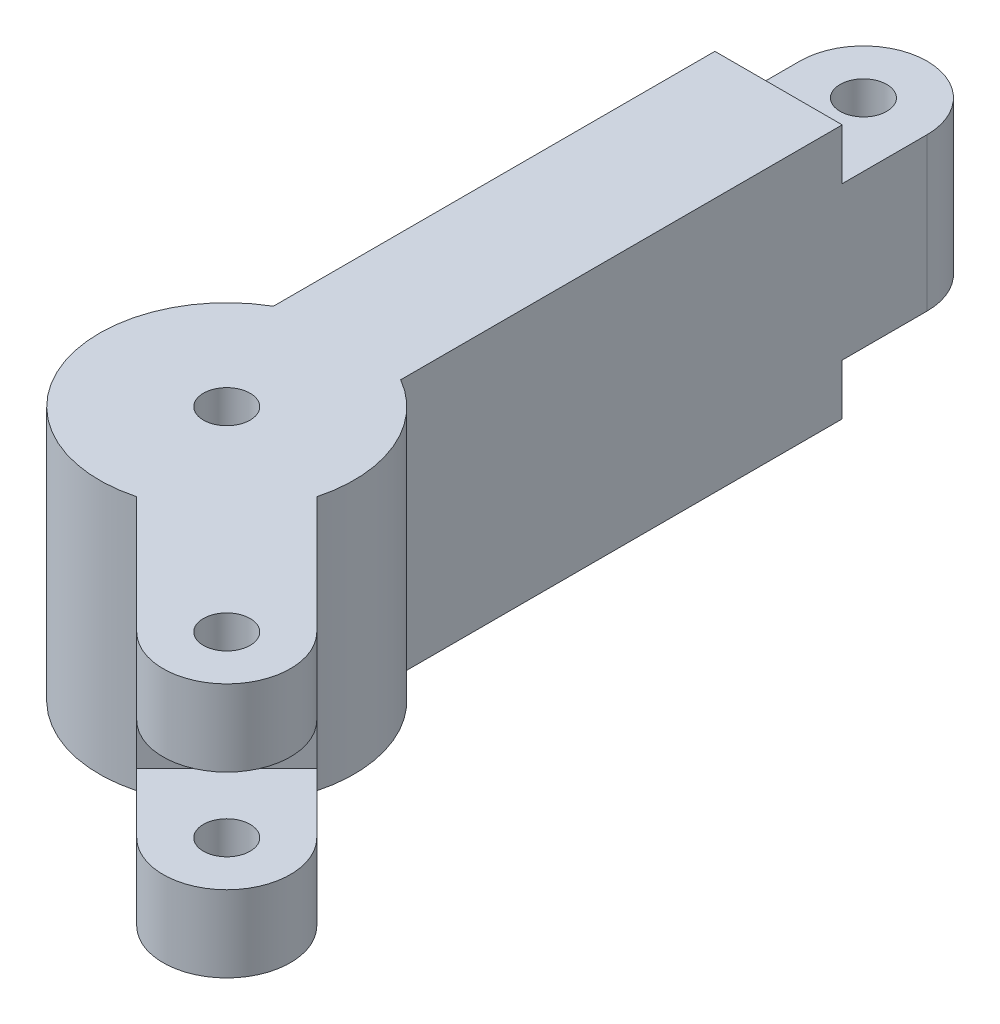
ISO-10303-21;
HEADER;
FILE_DESCRIPTION(('STEP AP214'),'2;1');
FILE_NAME('part.step','',(''),(''),'','','');
FILE_SCHEMA(('AUTOMOTIVE_DESIGN { 1 0 10303 214 1 1 1 1 }'));
ENDSEC;
DATA;
#1=APPLICATION_CONTEXT('core data for automotive mechanical design processes');
#2=APPLICATION_PROTOCOL_DEFINITION('international standard','automotive_design',2000,#1);
#3=PRODUCT_CONTEXT('',#1,'mechanical');
#4=PRODUCT('Part','Part','',(#3));
#5=PRODUCT_RELATED_PRODUCT_CATEGORY('part','',(#4));
#6=PRODUCT_DEFINITION_FORMATION('','',#4);
#7=PRODUCT_DEFINITION_CONTEXT('part definition',#1,'design');
#8=PRODUCT_DEFINITION('design','',#6,#7);
#9=PRODUCT_DEFINITION_SHAPE('','',#8);
#10=(LENGTH_UNIT() NAMED_UNIT(*) SI_UNIT(.MILLI.,.METRE.));
#11=(NAMED_UNIT(*) PLANE_ANGLE_UNIT() SI_UNIT($,.RADIAN.));
#12=(NAMED_UNIT(*) SI_UNIT($,.STERADIAN.) SOLID_ANGLE_UNIT());
#13=UNCERTAINTY_MEASURE_WITH_UNIT(LENGTH_MEASURE(1.E-05),#10,'distance_accuracy_value','');
#14=(GEOMETRIC_REPRESENTATION_CONTEXT(3) GLOBAL_UNCERTAINTY_ASSIGNED_CONTEXT((#13)) GLOBAL_UNIT_ASSIGNED_CONTEXT((#10,
#11,#12)) REPRESENTATION_CONTEXT('',''));
#15=CARTESIAN_POINT('',(0.,0.,0.));
#16=DIRECTION('',(0.,0.,1.));
#17=DIRECTION('',(1.,0.,0.));
#18=AXIS2_PLACEMENT_3D('',#15,#16,#17);
#19=CARTESIAN_POINT('',(-5.3033008588991,30.,5.3033008588991));
#20=DIRECTION('',(0.707106781186548,0.,-0.707106781186547));
#21=DIRECTION('',(-0.707106781186547,0.,-0.707106781186548));
#22=AXIS2_PLACEMENT_3D('',#19,#20,#21);
#23=PLANE('',#22);
#24=DIRECTION('',(0.707106781186547,0.,0.707106781186548));
#25=VECTOR('',#24,1.);
#26=CARTESIAN_POINT('',(-5.3033008588991,9.,5.3033008588991));
#27=LINE('',#26,#25);
#28=CARTESIAN_POINT('',(10.6066017177982,9.,21.2132034355964));
#29=VERTEX_POINT('',#28);
#30=CARTESIAN_POINT('',(17.6776695296637,9.,28.2842712474619));
#31=VERTEX_POINT('',#30);
#32=EDGE_CURVE('E181',#29,#31,#27,.T.);
#33=ORIENTED_EDGE('',*,*,#32,.F.);
#34=DIRECTION('',(0.,-1.,0.));
#35=VECTOR('',#34,1.);
#36=CARTESIAN_POINT('',(10.6066017177982,30.,21.2132034355964));
#37=LINE('',#36,#35);
#38=CARTESIAN_POINT('',(10.6066017177982,21.,21.2132034355964));
#39=VERTEX_POINT('',#38);
#40=EDGE_CURVE('E183',#39,#29,#37,.T.);
#41=ORIENTED_EDGE('',*,*,#40,.F.);
#42=DIRECTION('',(-0.707106781186547,0.,-0.707106781186548));
#43=VECTOR('',#42,1.);
#44=CARTESIAN_POINT('',(-5.3033008588991,21.,5.3033008588991));
#45=LINE('',#44,#43);
#46=CARTESIAN_POINT('',(17.6776695296637,21.,28.2842712474619));
#47=VERTEX_POINT('',#46);
#48=EDGE_CURVE('E156',#47,#39,#45,.T.);
#49=ORIENTED_EDGE('',*,*,#48,.F.);
#50=DIRECTION('',(0.,-1.,0.));
#51=VECTOR('',#50,1.);
#52=CARTESIAN_POINT('',(17.6776695296637,30.,28.2842712474619));
#53=LINE('',#52,#51);
#54=CARTESIAN_POINT('',(17.6776695296637,30.,28.2842712474619));
#55=VERTEX_POINT('',#54);
#56=EDGE_CURVE('E279',#55,#47,#53,.T.);
#57=ORIENTED_EDGE('',*,*,#56,.F.);
#58=DIRECTION('',(0.707106781186547,0.,0.707106781186548));
#59=VECTOR('',#58,1.);
#60=CARTESIAN_POINT('',(-5.3033008588991,30.,5.3033008588991));
#61=LINE('',#60,#59);
#62=CARTESIAN_POINT('',(3.88228567653782,30.,14.488887394336));
#63=VERTEX_POINT('',#62);
#64=EDGE_CURVE('E219',#63,#55,#61,.T.);
#65=ORIENTED_EDGE('',*,*,#64,.F.);
#66=DIRECTION('',(0.,-1.,0.));
#67=VECTOR('',#66,1.);
#68=CARTESIAN_POINT('',(3.88228567653782,30.,14.488887394336));
#69=LINE('',#68,#67);
#70=CARTESIAN_POINT('',(3.88228567653782,0.,14.488887394336));
#71=VERTEX_POINT('',#70);
#72=EDGE_CURVE('E282',#63,#71,#69,.T.);
#73=ORIENTED_EDGE('',*,*,#72,.T.);
#74=DIRECTION('',(0.707106781186547,0.,0.707106781186548));
#75=VECTOR('',#74,1.);
#76=CARTESIAN_POINT('',(-5.3033008588991,0.,5.3033008588991));
#77=LINE('',#76,#75);
#78=CARTESIAN_POINT('',(17.6776695296637,0.,28.2842712474619));
#79=VERTEX_POINT('',#78);
#80=EDGE_CURVE('E242',#71,#79,#77,.T.);
#81=ORIENTED_EDGE('',*,*,#80,.T.);
#82=EDGE_CURVE('E278',#31,#79,#53,.T.);
#83=ORIENTED_EDGE('',*,*,#82,.F.);
#84=EDGE_LOOP('',(#33,#41,#49,#57,#65,#73,#81,#83));
#85=FACE_BOUND('',#84,.T.);
#86=ADVANCED_FACE('F33',(#85),#23,.F.);
#87=CARTESIAN_POINT('',(22.9809703885628,30.,22.9809703885628));
#88=DIRECTION('',(0.,-1.,0.));
#89=DIRECTION('',(0.,0.,-1.));
#90=AXIS2_PLACEMENT_3D('',#87,#88,#89);
#91=CYLINDRICAL_SURFACE('',#90,7.5);
#92=CARTESIAN_POINT('',(22.9809703885628,9.,22.9809703885628));
#93=DIRECTION('',(0.,1.,0.));
#94=DIRECTION('',(0.,0.,1.));
#95=AXIS2_PLACEMENT_3D('',#92,#93,#94);
#96=CIRCLE('',#95,7.5);
#97=CARTESIAN_POINT('',(28.2842712474619,9.,17.6776695296637));
#98=VERTEX_POINT('',#97);
#99=EDGE_CURVE('E179',#31,#98,#96,.T.);
#100=ORIENTED_EDGE('',*,*,#99,.F.);
#101=ORIENTED_EDGE('',*,*,#82,.T.);
#102=CARTESIAN_POINT('',(22.9809703885628,0.,22.9809703885628));
#103=DIRECTION('',(0.,1.,0.));
#104=DIRECTION('',(0.,0.,1.));
#105=AXIS2_PLACEMENT_3D('',#102,#103,#104);
#106=CIRCLE('',#105,7.5);
#107=CARTESIAN_POINT('',(28.2842712474619,0.,17.6776695296637));
#108=VERTEX_POINT('',#107);
#109=EDGE_CURVE('E245',#79,#108,#106,.T.);
#110=ORIENTED_EDGE('',*,*,#109,.T.);
#111=DIRECTION('',(0.,-1.,0.));
#112=VECTOR('',#111,1.);
#113=CARTESIAN_POINT('',(28.2842712474619,30.,17.6776695296637));
#114=LINE('',#113,#112);
#115=EDGE_CURVE('E276',#98,#108,#114,.T.);
#116=ORIENTED_EDGE('',*,*,#115,.F.);
#117=EDGE_LOOP('',(#100,#101,#110,#116));
#118=FACE_BOUND('',#117,.T.);
#119=ADVANCED_FACE('F306',(#118),#91,.T.);
#120=CARTESIAN_POINT('',(22.9809703885628,21.,22.9809703885628));
#121=DIRECTION('',(0.,-1.,0.));
#122=DIRECTION('',(0.,0.,-1.));
#123=AXIS2_PLACEMENT_3D('',#120,#121,#122);
#124=CIRCLE('',#123,7.5);
#125=CARTESIAN_POINT('',(28.2842712474619,21.,17.6776695296637));
#126=VERTEX_POINT('',#125);
#127=EDGE_CURVE('E176',#126,#47,#124,.T.);
#128=ORIENTED_EDGE('',*,*,#127,.F.);
#129=CARTESIAN_POINT('',(28.2842712474619,30.,17.6776695296637));
#130=VERTEX_POINT('',#129);
#131=EDGE_CURVE('E171',#130,#126,#114,.T.);
#132=ORIENTED_EDGE('',*,*,#131,.F.);
#133=CARTESIAN_POINT('',(22.9809703885628,30.,22.9809703885628));
#134=DIRECTION('',(0.,1.,0.));
#135=DIRECTION('',(0.,0.,1.));
#136=AXIS2_PLACEMENT_3D('',#133,#134,#135);
#137=CIRCLE('',#136,7.5);
#138=EDGE_CURVE('E222',#55,#130,#137,.T.);
#139=ORIENTED_EDGE('',*,*,#138,.F.);
#140=ORIENTED_EDGE('',*,*,#56,.T.);
#141=EDGE_LOOP('',(#128,#132,#139,#140));
#142=FACE_BOUND('',#141,.T.);
#143=ADVANCED_FACE('F311',(#142),#91,.T.);
#144=CARTESIAN_POINT('',(5.3033008588991,30.,-5.3033008588991));
#145=DIRECTION('',(0.707106781186547,0.,-0.707106781186548));
#146=DIRECTION('',(-0.707106781186548,0.,-0.707106781186547));
#147=AXIS2_PLACEMENT_3D('',#144,#145,#146);
#148=PLANE('',#147);
#149=DIRECTION('',(0.,-1.,0.));
#150=VECTOR('',#149,1.);
#151=CARTESIAN_POINT('',(21.2132034355964,0.,10.6066017177982));
#152=LINE('',#151,#150);
#153=CARTESIAN_POINT('',(21.2132034355964,21.,10.6066017177982));
#154=VERTEX_POINT('',#153);
#155=CARTESIAN_POINT('',(21.2132034355964,9.,10.6066017177982));
#156=VERTEX_POINT('',#155);
#157=EDGE_CURVE('E163',#154,#156,#152,.T.);
#158=ORIENTED_EDGE('',*,*,#157,.T.);
#159=DIRECTION('',(0.707106781186548,0.,0.707106781186547));
#160=VECTOR('',#159,1.);
#161=CARTESIAN_POINT('',(5.3033008588991,9.,-5.3033008588991));
#162=LINE('',#161,#160);
#163=EDGE_CURVE('E50',#156,#98,#162,.T.);
#164=ORIENTED_EDGE('',*,*,#163,.T.);
#165=ORIENTED_EDGE('',*,*,#115,.T.);
#166=DIRECTION('',(0.707106781186548,0.,0.707106781186547));
#167=VECTOR('',#166,1.);
#168=CARTESIAN_POINT('',(5.3033008588991,0.,-5.3033008588991));
#169=LINE('',#168,#167);
#170=CARTESIAN_POINT('',(14.488887394336,0.,3.88228567653781));
#171=VERTEX_POINT('',#170);
#172=EDGE_CURVE('E248',#171,#108,#169,.T.);
#173=ORIENTED_EDGE('',*,*,#172,.F.);
#174=DIRECTION('',(0.,-1.,0.));
#175=VECTOR('',#174,1.);
#176=CARTESIAN_POINT('',(14.488887394336,30.,3.88228567653781));
#177=LINE('',#176,#175);
#178=CARTESIAN_POINT('',(14.488887394336,30.,3.88228567653781));
#179=VERTEX_POINT('',#178);
#180=EDGE_CURVE('E274',#179,#171,#177,.T.);
#181=ORIENTED_EDGE('',*,*,#180,.F.);
#182=DIRECTION('',(0.707106781186548,0.,0.707106781186547));
#183=VECTOR('',#182,1.);
#184=CARTESIAN_POINT('',(5.3033008588991,30.,-5.3033008588991));
#185=LINE('',#184,#183);
#186=EDGE_CURVE('E224',#179,#130,#185,.T.);
#187=ORIENTED_EDGE('',*,*,#186,.T.);
#188=ORIENTED_EDGE('',*,*,#131,.T.);
#189=DIRECTION('',(-0.707106781186548,0.,-0.707106781186547));
#190=VECTOR('',#189,1.);
#191=CARTESIAN_POINT('',(5.3033008588991,21.,-5.3033008588991));
#192=LINE('',#191,#190);
#193=EDGE_CURVE('E153',#126,#154,#192,.T.);
#194=ORIENTED_EDGE('',*,*,#193,.T.);
#195=EDGE_LOOP('',(#158,#164,#165,#173,#181,#187,#188,#194));
#196=FACE_BOUND('',#195,.T.);
#197=ADVANCED_FACE('F168',(#196),#148,.T.);
#198=CARTESIAN_POINT('',(22.9809703885628,30.,22.9809703885628));
#199=DIRECTION('',(0.,-1.,0.));
#200=DIRECTION('',(0.,0.,-1.));
#201=AXIS2_PLACEMENT_3D('',#198,#199,#200);
#202=CYLINDRICAL_SURFACE('',#201,2.75);
#203=CARTESIAN_POINT('',(22.9809703885628,0.,22.9809703885628));
#204=DIRECTION('',(0.,1.,0.));
#205=DIRECTION('',(0.,0.,1.));
#206=AXIS2_PLACEMENT_3D('',#203,#204,#205);
#207=CIRCLE('',#206,2.75);
#208=CARTESIAN_POINT('',(22.9809703885628,0.,25.7309703885628));
#209=VERTEX_POINT('',#208);
#210=EDGE_CURVE('E220',#209,#209,#207,.T.);
#211=ORIENTED_EDGE('',*,*,#210,.F.);
#212=EDGE_LOOP('',(#211));
#213=FACE_BOUND('',#212,.T.);
#214=CARTESIAN_POINT('',(22.9809703885628,9.,22.9809703885628));
#215=DIRECTION('',(0.,1.,0.));
#216=DIRECTION('',(0.,0.,1.));
#217=AXIS2_PLACEMENT_3D('',#214,#215,#216);
#218=CIRCLE('',#217,2.75);
#219=CARTESIAN_POINT('',(22.9809703885628,9.,25.7309703885628));
#220=VERTEX_POINT('',#219);
#221=EDGE_CURVE('E37',#220,#220,#218,.T.);
#222=ORIENTED_EDGE('',*,*,#221,.T.);
#223=EDGE_LOOP('',(#222));
#224=FACE_BOUND('',#223,.T.);
#225=ADVANCED_FACE('F318',(#213,#224),#202,.F.);
#226=CARTESIAN_POINT('',(22.9809703885628,30.,22.9809703885628));
#227=DIRECTION('',(0.,1.,0.));
#228=DIRECTION('',(0.,0.,1.));
#229=AXIS2_PLACEMENT_3D('',#226,#227,#228);
#230=CIRCLE('',#229,2.75);
#231=CARTESIAN_POINT('',(22.9809703885628,30.,25.7309703885628));
#232=VERTEX_POINT('',#231);
#233=EDGE_CURVE('E236',#232,#232,#230,.T.);
#234=ORIENTED_EDGE('',*,*,#233,.T.);
#235=EDGE_LOOP('',(#234));
#236=FACE_BOUND('',#235,.T.);
#237=CARTESIAN_POINT('',(22.9809703885628,21.,22.9809703885628));
#238=DIRECTION('',(0.,-1.,0.));
#239=DIRECTION('',(0.,0.,-1.));
#240=AXIS2_PLACEMENT_3D('',#237,#238,#239);
#241=CIRCLE('',#240,2.75);
#242=CARTESIAN_POINT('',(22.9809703885628,21.,20.2309703885628));
#243=VERTEX_POINT('',#242);
#244=EDGE_CURVE('E159',#243,#243,#241,.T.);
#245=ORIENTED_EDGE('',*,*,#244,.T.);
#246=EDGE_LOOP('',(#245));
#247=FACE_BOUND('',#246,.T.);
#248=ADVANCED_FACE('F294',(#236,#247),#202,.F.);
#249=CARTESIAN_POINT('',(7.50000000000001,30.,0.));
#250=DIRECTION('',(1.,0.,0.));
#251=DIRECTION('',(0.,0.,-1.));
#252=AXIS2_PLACEMENT_3D('',#249,#250,#251);
#253=PLANE('',#252);
#254=DIRECTION('',(0.,0.,1.));
#255=VECTOR('',#254,1.);
#256=CARTESIAN_POINT('',(7.50000000000001,6.,0.));
#257=LINE('',#256,#255);
#258=CARTESIAN_POINT('',(7.5,6.,-75.));
#259=VERTEX_POINT('',#258);
#260=CARTESIAN_POINT('',(7.5,6.,-65.));
#261=VERTEX_POINT('',#260);
#262=EDGE_CURVE('E186',#259,#261,#257,.T.);
#263=ORIENTED_EDGE('',*,*,#262,.F.);
#264=DIRECTION('',(0.,-1.,0.));
#265=VECTOR('',#264,1.);
#266=CARTESIAN_POINT('',(7.5,30.,-75.));
#267=LINE('',#266,#265);
#268=CARTESIAN_POINT('',(7.5,24.,-75.));
#269=VERTEX_POINT('',#268);
#270=EDGE_CURVE('E268',#269,#259,#267,.T.);
#271=ORIENTED_EDGE('',*,*,#270,.F.);
#272=DIRECTION('',(0.,0.,-1.));
#273=VECTOR('',#272,1.);
#274=CARTESIAN_POINT('',(7.50000000000001,24.,0.));
#275=LINE('',#274,#273);
#276=CARTESIAN_POINT('',(7.5,24.,-65.));
#277=VERTEX_POINT('',#276);
#278=EDGE_CURVE('E197',#277,#269,#275,.T.);
#279=ORIENTED_EDGE('',*,*,#278,.F.);
#280=DIRECTION('',(0.,1.,0.));
#281=VECTOR('',#280,1.);
#282=CARTESIAN_POINT('',(7.5,0.,-65.));
#283=LINE('',#282,#281);
#284=CARTESIAN_POINT('',(7.5,30.,-65.));
#285=VERTEX_POINT('',#284);
#286=EDGE_CURVE('E185',#277,#285,#283,.T.);
#287=ORIENTED_EDGE('',*,*,#286,.T.);
#288=DIRECTION('',(0.,0.,1.));
#289=VECTOR('',#288,1.);
#290=CARTESIAN_POINT('',(7.50000000000001,30.,0.));
#291=LINE('',#290,#289);
#292=CARTESIAN_POINT('',(7.50000000000001,30.,-12.9903810567666));
#293=VERTEX_POINT('',#292);
#294=EDGE_CURVE('E229',#285,#293,#291,.T.);
#295=ORIENTED_EDGE('',*,*,#294,.T.);
#296=DIRECTION('',(0.,-1.,0.));
#297=VECTOR('',#296,1.);
#298=CARTESIAN_POINT('',(7.50000000000001,30.,-12.9903810567666));
#299=LINE('',#298,#297);
#300=CARTESIAN_POINT('',(7.50000000000001,0.,-12.9903810567666));
#301=VERTEX_POINT('',#300);
#302=EDGE_CURVE('E271',#293,#301,#299,.T.);
#303=ORIENTED_EDGE('',*,*,#302,.T.);
#304=DIRECTION('',(0.,0.,1.));
#305=VECTOR('',#304,1.);
#306=CARTESIAN_POINT('',(7.50000000000001,0.,0.));
#307=LINE('',#306,#305);
#308=CARTESIAN_POINT('',(7.5,0.,-65.));
#309=VERTEX_POINT('',#308);
#310=EDGE_CURVE('E254',#309,#301,#307,.T.);
#311=ORIENTED_EDGE('',*,*,#310,.F.);
#312=DIRECTION('',(0.,-1.,0.));
#313=VECTOR('',#312,1.);
#314=CARTESIAN_POINT('',(7.5,0.,-65.));
#315=LINE('',#314,#313);
#316=EDGE_CURVE('E189',#261,#309,#315,.T.);
#317=ORIENTED_EDGE('',*,*,#316,.F.);
#318=EDGE_LOOP('',(#263,#271,#279,#287,#295,#303,#311,#317));
#319=FACE_BOUND('',#318,.T.);
#320=ADVANCED_FACE('F324',(#319),#253,.T.);
#321=CARTESIAN_POINT('',(-7.49999999999999,30.,0.));
#322=DIRECTION('',(1.,0.,0.));
#323=DIRECTION('',(0.,0.,-1.));
#324=AXIS2_PLACEMENT_3D('',#321,#322,#323);
#325=PLANE('',#324);
#326=DIRECTION('',(0.,-1.,0.));
#327=VECTOR('',#326,1.);
#328=CARTESIAN_POINT('',(-7.5,30.,-75.));
#329=LINE('',#328,#327);
#330=CARTESIAN_POINT('',(-7.5,24.,-75.));
#331=VERTEX_POINT('',#330);
#332=CARTESIAN_POINT('',(-7.5,6.,-75.));
#333=VERTEX_POINT('',#332);
#334=EDGE_CURVE('E265',#331,#333,#329,.T.);
#335=ORIENTED_EDGE('',*,*,#334,.T.);
#336=DIRECTION('',(0.,0.,1.));
#337=VECTOR('',#336,1.);
#338=CARTESIAN_POINT('',(-7.49999999999999,6.,0.));
#339=LINE('',#338,#337);
#340=CARTESIAN_POINT('',(-7.5,6.,-65.));
#341=VERTEX_POINT('',#340);
#342=EDGE_CURVE('E11',#333,#341,#339,.T.);
#343=ORIENTED_EDGE('',*,*,#342,.T.);
#344=DIRECTION('',(0.,-1.,0.));
#345=VECTOR('',#344,1.);
#346=CARTESIAN_POINT('',(-7.5,30.,-65.));
#347=LINE('',#346,#345);
#348=CARTESIAN_POINT('',(-7.5,0.,-65.));
#349=VERTEX_POINT('',#348);
#350=EDGE_CURVE('E194',#341,#349,#347,.T.);
#351=ORIENTED_EDGE('',*,*,#350,.T.);
#352=DIRECTION('',(0.,0.,1.));
#353=VECTOR('',#352,1.);
#354=CARTESIAN_POINT('',(-7.49999999999999,0.,0.));
#355=LINE('',#354,#353);
#356=CARTESIAN_POINT('',(-7.49999999999999,0.,-12.9903810567666));
#357=VERTEX_POINT('',#356);
#358=EDGE_CURVE('E256',#349,#357,#355,.T.);
#359=ORIENTED_EDGE('',*,*,#358,.T.);
#360=DIRECTION('',(0.,-1.,0.));
#361=VECTOR('',#360,1.);
#362=CARTESIAN_POINT('',(-7.49999999999999,30.,-12.9903810567666));
#363=LINE('',#362,#361);
#364=CARTESIAN_POINT('',(-7.49999999999999,30.,-12.9903810567666));
#365=VERTEX_POINT('',#364);
#366=EDGE_CURVE('E239',#365,#357,#363,.T.);
#367=ORIENTED_EDGE('',*,*,#366,.F.);
#368=DIRECTION('',(0.,0.,1.));
#369=VECTOR('',#368,1.);
#370=CARTESIAN_POINT('',(-7.49999999999999,30.,0.));
#371=LINE('',#370,#369);
#372=CARTESIAN_POINT('',(-7.5,30.,-65.));
#373=VERTEX_POINT('',#372);
#374=EDGE_CURVE('E231',#373,#365,#371,.T.);
#375=ORIENTED_EDGE('',*,*,#374,.F.);
#376=DIRECTION('',(0.,1.,0.));
#377=VECTOR('',#376,1.);
#378=CARTESIAN_POINT('',(-7.5,30.,-65.));
#379=LINE('',#378,#377);
#380=CARTESIAN_POINT('',(-7.5,24.,-65.));
#381=VERTEX_POINT('',#380);
#382=EDGE_CURVE('E58',#381,#373,#379,.T.);
#383=ORIENTED_EDGE('',*,*,#382,.F.);
#384=DIRECTION('',(0.,0.,-1.));
#385=VECTOR('',#384,1.);
#386=CARTESIAN_POINT('',(-7.49999999999999,24.,0.));
#387=LINE('',#386,#385);
#388=EDGE_CURVE('E42',#381,#331,#387,.T.);
#389=ORIENTED_EDGE('',*,*,#388,.T.);
#390=EDGE_LOOP('',(#335,#343,#351,#359,#367,#375,#383,#389));
#391=FACE_BOUND('',#390,.T.);
#392=ADVANCED_FACE('F327',(#391),#325,.F.);
#393=CARTESIAN_POINT('',(0.,30.,0.));
#394=DIRECTION('',(0.,1.,0.));
#395=DIRECTION('',(0.,0.,1.));
#396=AXIS2_PLACEMENT_3D('',#393,#394,#395);
#397=PLANE('',#396);
#398=ORIENTED_EDGE('',*,*,#233,.F.);
#399=EDGE_LOOP('',(#398));
#400=FACE_BOUND('',#399,.T.);
#401=CARTESIAN_POINT('',(0.,30.,0.));
#402=DIRECTION('',(0.,1.,0.));
#403=DIRECTION('',(0.,0.,1.));
#404=AXIS2_PLACEMENT_3D('',#401,#402,#403);
#405=CIRCLE('',#404,2.75);
#406=CARTESIAN_POINT('',(0.,30.,2.75));
#407=VERTEX_POINT('',#406);
#408=EDGE_CURVE('E233',#407,#407,#405,.T.);
#409=ORIENTED_EDGE('',*,*,#408,.F.);
#410=EDGE_LOOP('',(#409));
#411=FACE_BOUND('',#410,.T.);
#412=ORIENTED_EDGE('',*,*,#294,.F.);
#413=DIRECTION('',(-1.,0.,0.));
#414=VECTOR('',#413,1.);
#415=CARTESIAN_POINT('',(0.,30.,-65.));
#416=LINE('',#415,#414);
#417=EDGE_CURVE('E288',#285,#373,#416,.T.);
#418=ORIENTED_EDGE('',*,*,#417,.T.);
#419=ORIENTED_EDGE('',*,*,#374,.T.);
#420=CARTESIAN_POINT('',(0.,30.,0.));
#421=DIRECTION('',(0.,1.,0.));
#422=DIRECTION('',(0.,0.,1.));
#423=AXIS2_PLACEMENT_3D('',#420,#421,#422);
#424=CIRCLE('',#423,15.);
#425=EDGE_CURVE('E216',#365,#63,#424,.T.);
#426=ORIENTED_EDGE('',*,*,#425,.T.);
#427=ORIENTED_EDGE('',*,*,#64,.T.);
#428=ORIENTED_EDGE('',*,*,#138,.T.);
#429=ORIENTED_EDGE('',*,*,#186,.F.);
#430=CARTESIAN_POINT('',(0.,30.,0.));
#431=DIRECTION('',(0.,1.,0.));
#432=DIRECTION('',(0.,0.,1.));
#433=AXIS2_PLACEMENT_3D('',#430,#431,#432);
#434=CIRCLE('',#433,15.);
#435=EDGE_CURVE('E226',#179,#293,#434,.T.);
#436=ORIENTED_EDGE('',*,*,#435,.T.);
#437=EDGE_LOOP('',(#412,#418,#419,#426,#427,#428,#429,#436));
#438=FACE_BOUND('',#437,.T.);
#439=ADVANCED_FACE('F335',(#400,#411,#438),#397,.T.);
#440=CARTESIAN_POINT('',(0.,30.,0.));
#441=DIRECTION('',(0.,-1.,0.));
#442=DIRECTION('',(0.,0.,-1.));
#443=AXIS2_PLACEMENT_3D('',#440,#441,#442);
#444=CYLINDRICAL_SURFACE('',#443,15.);
#445=CARTESIAN_POINT('',(0.,0.,0.));
#446=DIRECTION('',(0.,1.,0.));
#447=DIRECTION('',(0.,0.,1.));
#448=AXIS2_PLACEMENT_3D('',#445,#446,#447);
#449=CIRCLE('',#448,15.);
#450=EDGE_CURVE('E215',#357,#71,#449,.T.);
#451=ORIENTED_EDGE('',*,*,#450,.T.);
#452=ORIENTED_EDGE('',*,*,#72,.F.);
#453=ORIENTED_EDGE('',*,*,#425,.F.);
#454=ORIENTED_EDGE('',*,*,#366,.T.);
#455=EDGE_LOOP('',(#451,#452,#453,#454));
#456=FACE_BOUND('',#455,.T.);
#457=ADVANCED_FACE('F35',(#456),#444,.T.);
#458=CARTESIAN_POINT('',(0.,30.,0.));
#459=DIRECTION('',(0.,-1.,0.));
#460=DIRECTION('',(0.,0.,-1.));
#461=AXIS2_PLACEMENT_3D('',#458,#459,#460);
#462=CYLINDRICAL_SURFACE('',#461,15.);
#463=CARTESIAN_POINT('',(0.,0.,0.));
#464=DIRECTION('',(0.,1.,0.));
#465=DIRECTION('',(0.,0.,1.));
#466=AXIS2_PLACEMENT_3D('',#463,#464,#465);
#467=CIRCLE('',#466,15.);
#468=EDGE_CURVE('E251',#171,#301,#467,.T.);
#469=ORIENTED_EDGE('',*,*,#468,.T.);
#470=ORIENTED_EDGE('',*,*,#302,.F.);
#471=ORIENTED_EDGE('',*,*,#435,.F.);
#472=ORIENTED_EDGE('',*,*,#180,.T.);
#473=EDGE_LOOP('',(#469,#470,#471,#472));
#474=FACE_BOUND('',#473,.T.);
#475=ADVANCED_FACE('F319',(#474),#462,.T.);
#476=CARTESIAN_POINT('',(0.,30.,-75.));
#477=DIRECTION('',(0.,-1.,0.));
#478=DIRECTION('',(0.,0.,-1.));
#479=AXIS2_PLACEMENT_3D('',#476,#477,#478);
#480=CYLINDRICAL_SURFACE('',#479,7.5);
#481=ORIENTED_EDGE('',*,*,#270,.T.);
#482=CARTESIAN_POINT('',(0.,6.,-75.));
#483=DIRECTION('',(0.,1.,0.));
#484=DIRECTION('',(0.,0.,1.));
#485=AXIS2_PLACEMENT_3D('',#482,#483,#484);
#486=CIRCLE('',#485,7.5);
#487=EDGE_CURVE('E209',#259,#333,#486,.T.);
#488=ORIENTED_EDGE('',*,*,#487,.T.);
#489=ORIENTED_EDGE('',*,*,#334,.F.);
#490=CARTESIAN_POINT('',(0.,24.,-75.));
#491=DIRECTION('',(0.,-1.,0.));
#492=DIRECTION('',(0.,0.,-1.));
#493=AXIS2_PLACEMENT_3D('',#490,#491,#492);
#494=CIRCLE('',#493,7.5);
#495=EDGE_CURVE('E203',#331,#269,#494,.T.);
#496=ORIENTED_EDGE('',*,*,#495,.T.);
#497=EDGE_LOOP('',(#481,#488,#489,#496));
#498=FACE_BOUND('',#497,.T.);
#499=ADVANCED_FACE('F322',(#498),#480,.T.);
#500=CARTESIAN_POINT('',(0.,30.,0.));
#501=DIRECTION('',(0.,-1.,0.));
#502=DIRECTION('',(0.,0.,-1.));
#503=AXIS2_PLACEMENT_3D('',#500,#501,#502);
#504=CYLINDRICAL_SURFACE('',#503,2.75);
#505=ORIENTED_EDGE('',*,*,#408,.T.);
#506=EDGE_LOOP('',(#505));
#507=FACE_BOUND('',#506,.T.);
#508=CARTESIAN_POINT('',(0.,0.,0.));
#509=DIRECTION('',(0.,1.,0.));
#510=DIRECTION('',(0.,0.,1.));
#511=AXIS2_PLACEMENT_3D('',#508,#509,#510);
#512=CIRCLE('',#511,2.75);
#513=CARTESIAN_POINT('',(0.,0.,2.75));
#514=VERTEX_POINT('',#513);
#515=EDGE_CURVE('E258',#514,#514,#512,.T.);
#516=ORIENTED_EDGE('',*,*,#515,.F.);
#517=EDGE_LOOP('',(#516));
#518=FACE_BOUND('',#517,.T.);
#519=ADVANCED_FACE('F331',(#507,#518),#504,.F.);
#520=CARTESIAN_POINT('',(0.,0.,0.));
#521=DIRECTION('',(0.,1.,0.));
#522=DIRECTION('',(0.,0.,1.));
#523=AXIS2_PLACEMENT_3D('',#520,#521,#522);
#524=PLANE('',#523);
#525=ORIENTED_EDGE('',*,*,#358,.F.);
#526=DIRECTION('',(1.,0.,0.));
#527=VECTOR('',#526,1.);
#528=CARTESIAN_POINT('',(0.,0.,-65.));
#529=LINE('',#528,#527);
#530=EDGE_CURVE('E285',#349,#309,#529,.T.);
#531=ORIENTED_EDGE('',*,*,#530,.T.);
#532=ORIENTED_EDGE('',*,*,#310,.T.);
#533=ORIENTED_EDGE('',*,*,#468,.F.);
#534=ORIENTED_EDGE('',*,*,#172,.T.);
#535=ORIENTED_EDGE('',*,*,#109,.F.);
#536=ORIENTED_EDGE('',*,*,#80,.F.);
#537=ORIENTED_EDGE('',*,*,#450,.F.);
#538=EDGE_LOOP('',(#525,#531,#532,#533,#534,#535,#536,#537));
#539=FACE_BOUND('',#538,.T.);
#540=ORIENTED_EDGE('',*,*,#515,.T.);
#541=EDGE_LOOP('',(#540));
#542=FACE_BOUND('',#541,.T.);
#543=ORIENTED_EDGE('',*,*,#210,.T.);
#544=EDGE_LOOP('',(#543));
#545=FACE_BOUND('',#544,.T.);
#546=ADVANCED_FACE('F339',(#539,#542,#545),#524,.F.);
#547=CARTESIAN_POINT('',(-47.5,6.,0.));
#548=DIRECTION('',(0.,1.,0.));
#549=DIRECTION('',(0.,0.,1.));
#550=AXIS2_PLACEMENT_3D('',#547,#548,#549);
#551=PLANE('',#550);
#552=CARTESIAN_POINT('',(0.,6.,-75.));
#553=DIRECTION('',(0.,1.,0.));
#554=DIRECTION('',(0.,0.,1.));
#555=AXIS2_PLACEMENT_3D('',#552,#553,#554);
#556=CIRCLE('',#555,2.75);
#557=CARTESIAN_POINT('',(0.,6.,-72.25));
#558=VERTEX_POINT('',#557);
#559=EDGE_CURVE('E212',#558,#558,#556,.T.);
#560=ORIENTED_EDGE('',*,*,#559,.T.);
#561=EDGE_LOOP('',(#560));
#562=FACE_BOUND('',#561,.T.);
#563=ORIENTED_EDGE('',*,*,#262,.T.);
#564=DIRECTION('',(1.,0.,0.));
#565=VECTOR('',#564,1.);
#566=CARTESIAN_POINT('',(-47.5,6.,-65.));
#567=LINE('',#566,#565);
#568=EDGE_CURVE('E192',#341,#261,#567,.T.);
#569=ORIENTED_EDGE('',*,*,#568,.F.);
#570=ORIENTED_EDGE('',*,*,#342,.F.);
#571=ORIENTED_EDGE('',*,*,#487,.F.);
#572=EDGE_LOOP('',(#563,#569,#570,#571));
#573=FACE_BOUND('',#572,.T.);
#574=ADVANCED_FACE('F351',(#562,#573),#551,.F.);
#575=CARTESIAN_POINT('',(-47.5,0.,-65.));
#576=DIRECTION('',(0.,0.,1.));
#577=DIRECTION('',(1.,0.,0.));
#578=AXIS2_PLACEMENT_3D('',#575,#576,#577);
#579=PLANE('',#578);
#580=ORIENTED_EDGE('',*,*,#568,.T.);
#581=ORIENTED_EDGE('',*,*,#316,.T.);
#582=ORIENTED_EDGE('',*,*,#530,.F.);
#583=ORIENTED_EDGE('',*,*,#350,.F.);
#584=EDGE_LOOP('',(#580,#581,#582,#583));
#585=FACE_BOUND('',#584,.T.);
#586=ADVANCED_FACE('F361',(#585),#579,.F.);
#587=CARTESIAN_POINT('',(-47.5,24.,0.));
#588=DIRECTION('',(0.,-1.,0.));
#589=DIRECTION('',(0.,0.,-1.));
#590=AXIS2_PLACEMENT_3D('',#587,#588,#589);
#591=PLANE('',#590);
#592=CARTESIAN_POINT('',(0.,24.,-75.));
#593=DIRECTION('',(0.,-1.,0.));
#594=DIRECTION('',(0.,0.,-1.));
#595=AXIS2_PLACEMENT_3D('',#592,#593,#594);
#596=CIRCLE('',#595,2.75);
#597=CARTESIAN_POINT('',(0.,24.,-77.75));
#598=VERTEX_POINT('',#597);
#599=EDGE_CURVE('E206',#598,#598,#596,.T.);
#600=ORIENTED_EDGE('',*,*,#599,.T.);
#601=EDGE_LOOP('',(#600));
#602=FACE_BOUND('',#601,.T.);
#603=ORIENTED_EDGE('',*,*,#388,.F.);
#604=DIRECTION('',(1.,0.,0.));
#605=VECTOR('',#604,1.);
#606=CARTESIAN_POINT('',(-47.5,24.,-65.));
#607=LINE('',#606,#605);
#608=EDGE_CURVE('E190',#381,#277,#607,.T.);
#609=ORIENTED_EDGE('',*,*,#608,.T.);
#610=ORIENTED_EDGE('',*,*,#278,.T.);
#611=ORIENTED_EDGE('',*,*,#495,.F.);
#612=EDGE_LOOP('',(#603,#609,#610,#611));
#613=FACE_BOUND('',#612,.T.);
#614=ADVANCED_FACE('F358',(#602,#613),#591,.F.);
#615=CARTESIAN_POINT('',(-47.5,0.,-65.));
#616=DIRECTION('',(0.,0.,-1.));
#617=DIRECTION('',(-1.,0.,0.));
#618=AXIS2_PLACEMENT_3D('',#615,#616,#617);
#619=PLANE('',#618);
#620=ORIENTED_EDGE('',*,*,#382,.T.);
#621=ORIENTED_EDGE('',*,*,#417,.F.);
#622=ORIENTED_EDGE('',*,*,#286,.F.);
#623=ORIENTED_EDGE('',*,*,#608,.F.);
#624=EDGE_LOOP('',(#620,#621,#622,#623));
#625=FACE_BOUND('',#624,.T.);
#626=ADVANCED_FACE('F344',(#625),#619,.T.);
#627=CARTESIAN_POINT('',(0.,30.,-75.));
#628=DIRECTION('',(0.,-1.,0.));
#629=DIRECTION('',(0.,0.,-1.));
#630=AXIS2_PLACEMENT_3D('',#627,#628,#629);
#631=CYLINDRICAL_SURFACE('',#630,2.75);
#632=ORIENTED_EDGE('',*,*,#559,.F.);
#633=EDGE_LOOP('',(#632));
#634=FACE_BOUND('',#633,.T.);
#635=ORIENTED_EDGE('',*,*,#599,.F.);
#636=EDGE_LOOP('',(#635));
#637=FACE_BOUND('',#636,.T.);
#638=ADVANCED_FACE('F341',(#634,#637),#631,.F.);
#639=CARTESIAN_POINT('',(9.19238815542511,0.,22.6274169979695));
#640=DIRECTION('',(0.707106781186547,0.,0.707106781186547));
#641=DIRECTION('',(0.707106781186548,0.,-0.707106781186548));
#642=AXIS2_PLACEMENT_3D('',#639,#640,#641);
#643=PLANE('',#642);
#644=ORIENTED_EDGE('',*,*,#40,.T.);
#645=DIRECTION('',(0.707106781186547,0.,-0.707106781186547));
#646=VECTOR('',#645,1.);
#647=CARTESIAN_POINT('',(9.19238815542511,9.,22.6274169979695));
#648=LINE('',#647,#646);
#649=EDGE_CURVE('E160',#29,#156,#648,.T.);
#650=ORIENTED_EDGE('',*,*,#649,.T.);
#651=ORIENTED_EDGE('',*,*,#157,.F.);
#652=DIRECTION('',(0.707106781186547,0.,-0.707106781186547));
#653=VECTOR('',#652,1.);
#654=CARTESIAN_POINT('',(9.19238815542511,21.,22.6274169979695));
#655=LINE('',#654,#653);
#656=EDGE_CURVE('E149',#39,#154,#655,.T.);
#657=ORIENTED_EDGE('',*,*,#656,.F.);
#658=EDGE_LOOP('',(#644,#650,#651,#657));
#659=FACE_BOUND('',#658,.T.);
#660=ADVANCED_FACE('F164',(#659),#643,.T.);
#661=CARTESIAN_POINT('',(-6.71751442127221,9.,6.71751442127221));
#662=DIRECTION('',(0.,1.,0.));
#663=DIRECTION('',(0.,0.,1.));
#664=AXIS2_PLACEMENT_3D('',#661,#662,#663);
#665=PLANE('',#664);
#666=ORIENTED_EDGE('',*,*,#221,.F.);
#667=EDGE_LOOP('',(#666));
#668=FACE_BOUND('',#667,.T.);
#669=ORIENTED_EDGE('',*,*,#32,.T.);
#670=ORIENTED_EDGE('',*,*,#99,.T.);
#671=ORIENTED_EDGE('',*,*,#163,.F.);
#672=ORIENTED_EDGE('',*,*,#649,.F.);
#673=EDGE_LOOP('',(#669,#670,#671,#672));
#674=FACE_BOUND('',#673,.T.);
#675=ADVANCED_FACE('F297',(#668,#674),#665,.T.);
#676=CARTESIAN_POINT('',(-6.71751442127221,21.,6.71751442127221));
#677=DIRECTION('',(0.,-1.,0.));
#678=DIRECTION('',(0.,0.,-1.));
#679=AXIS2_PLACEMENT_3D('',#676,#677,#678);
#680=PLANE('',#679);
#681=ORIENTED_EDGE('',*,*,#244,.F.);
#682=EDGE_LOOP('',(#681));
#683=FACE_BOUND('',#682,.T.);
#684=ORIENTED_EDGE('',*,*,#48,.T.);
#685=ORIENTED_EDGE('',*,*,#656,.T.);
#686=ORIENTED_EDGE('',*,*,#193,.F.);
#687=ORIENTED_EDGE('',*,*,#127,.T.);
#688=EDGE_LOOP('',(#684,#685,#686,#687));
#689=FACE_BOUND('',#688,.T.);
#690=ADVANCED_FACE('F151',(#683,#689),#680,.T.);
#691=CLOSED_SHELL('',(#86,#119,#143,#197,#225,#248,#320,#392,#439,#457,#475,#499,#519,#546,#574,
#586,#614,#626,#638,#660,#675,#690));
#692=MANIFOLD_SOLID_BREP('B2',#691);
#693=ADVANCED_BREP_SHAPE_REPRESENTATION('',(#18,#692),#14);
#694=SHAPE_DEFINITION_REPRESENTATION(#9,#693);
ENDSEC;
END-ISO-10303-21;
